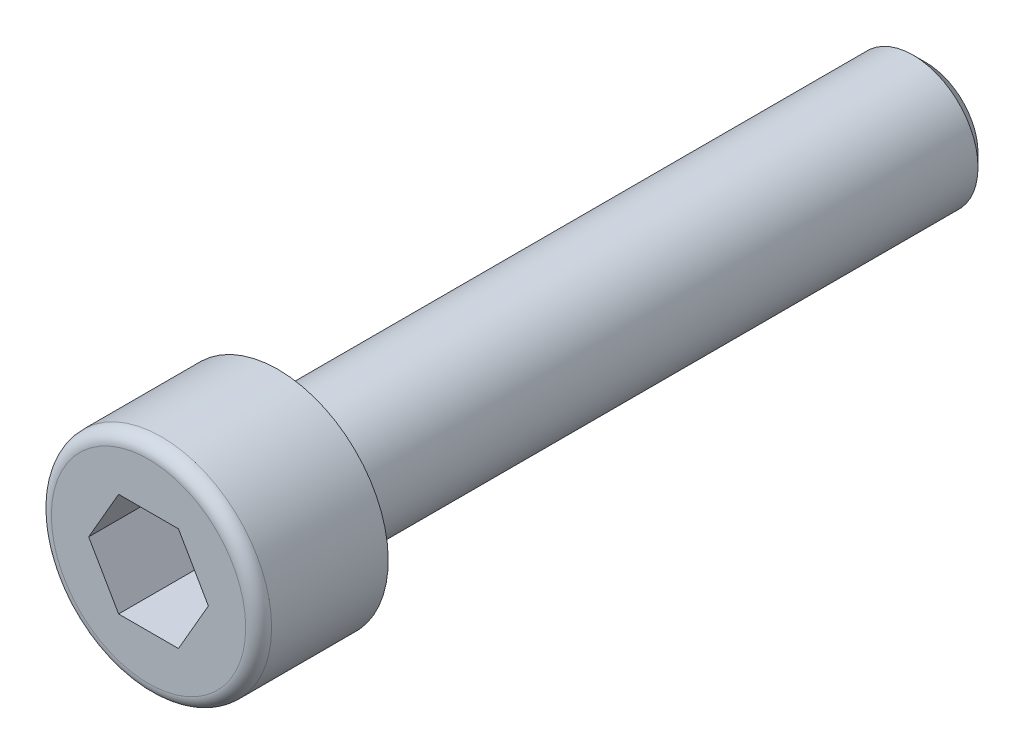
ISO-10303-21;
HEADER;
FILE_DESCRIPTION(('STEP AP214'),'2;1');
FILE_NAME('part.step','',(''),(''),'','','');
FILE_SCHEMA(('AUTOMOTIVE_DESIGN { 1 0 10303 214 1 1 1 1 }'));
ENDSEC;
DATA;
#1=APPLICATION_CONTEXT('core data for automotive mechanical design processes');
#2=APPLICATION_PROTOCOL_DEFINITION('international standard','automotive_design',2000,#1);
#3=PRODUCT_CONTEXT('',#1,'mechanical');
#4=PRODUCT('Part','Part','',(#3));
#5=PRODUCT_RELATED_PRODUCT_CATEGORY('part','',(#4));
#6=PRODUCT_DEFINITION_FORMATION('','',#4);
#7=PRODUCT_DEFINITION_CONTEXT('part definition',#1,'design');
#8=PRODUCT_DEFINITION('design','',#6,#7);
#9=PRODUCT_DEFINITION_SHAPE('','',#8);
#10=(LENGTH_UNIT() NAMED_UNIT(*) SI_UNIT(.MILLI.,.METRE.));
#11=(NAMED_UNIT(*) PLANE_ANGLE_UNIT() SI_UNIT($,.RADIAN.));
#12=(NAMED_UNIT(*) SI_UNIT($,.STERADIAN.) SOLID_ANGLE_UNIT());
#13=UNCERTAINTY_MEASURE_WITH_UNIT(LENGTH_MEASURE(1.E-05),#10,'distance_accuracy_value','');
#14=(GEOMETRIC_REPRESENTATION_CONTEXT(3) GLOBAL_UNCERTAINTY_ASSIGNED_CONTEXT((#13)) GLOBAL_UNIT_ASSIGNED_CONTEXT((#10,
#11,#12)) REPRESENTATION_CONTEXT('',''));
#15=CARTESIAN_POINT('',(0.,0.,0.));
#16=DIRECTION('',(0.,0.,1.));
#17=DIRECTION('',(1.,0.,0.));
#18=AXIS2_PLACEMENT_3D('',#15,#16,#17);
#19=CARTESIAN_POINT('',(0.,0.,1.17786788355576));
#20=DIRECTION('',(0.,0.,-1.));
#21=DIRECTION('',(0.,1.,0.));
#22=AXIS2_PLACEMENT_3D('',#19,#20,#21);
#23=PLANE('',#22);
#24=DIRECTION('',(0.500000000000001,-0.866025403784438,0.));
#25=VECTOR('',#24,1.);
#26=CARTESIAN_POINT('',(1.73205080756888,1.,1.17786788355576));
#27=LINE('',#26,#25);
#28=CARTESIAN_POINT('',(1.15470053837925,2.,1.17786788355576));
#29=VERTEX_POINT('',#28);
#30=CARTESIAN_POINT('',(2.3094010767585,0.,1.17786788355576));
#31=VERTEX_POINT('',#30);
#32=EDGE_CURVE('E72',#29,#31,#27,.T.);
#33=ORIENTED_EDGE('',*,*,#32,.F.);
#34=DIRECTION('',(1.,0.,0.));
#35=VECTOR('',#34,1.);
#36=CARTESIAN_POINT('',(0.,2.,1.17786788355576));
#37=LINE('',#36,#35);
#38=CARTESIAN_POINT('',(-1.15470053837925,2.,1.17786788355576));
#39=VERTEX_POINT('',#38);
#40=EDGE_CURVE('E221',#39,#29,#37,.T.);
#41=ORIENTED_EDGE('',*,*,#40,.F.);
#42=DIRECTION('',(0.5,0.866025403784439,0.));
#43=VECTOR('',#42,1.);
#44=CARTESIAN_POINT('',(-1.73205080756888,0.999999999999999,1.17786788355576));
#45=LINE('',#44,#43);
#46=CARTESIAN_POINT('',(-2.3094010767585,0.,1.17786788355576));
#47=VERTEX_POINT('',#46);
#48=EDGE_CURVE('E224',#47,#39,#45,.T.);
#49=ORIENTED_EDGE('',*,*,#48,.F.);
#50=DIRECTION('',(-0.500000000000001,0.866025403784438,0.));
#51=VECTOR('',#50,1.);
#52=CARTESIAN_POINT('',(-1.73205080756888,-1.,1.17786788355576));
#53=LINE('',#52,#51);
#54=CARTESIAN_POINT('',(-1.15470053837925,-2.,1.17786788355576));
#55=VERTEX_POINT('',#54);
#56=EDGE_CURVE('E229',#55,#47,#53,.T.);
#57=ORIENTED_EDGE('',*,*,#56,.F.);
#58=DIRECTION('',(1.,0.,0.));
#59=VECTOR('',#58,1.);
#60=CARTESIAN_POINT('',(0.,-2.,1.17786788355576));
#61=LINE('',#60,#59);
#62=CARTESIAN_POINT('',(1.15470053837925,-2.,1.17786788355576));
#63=VERTEX_POINT('',#62);
#64=EDGE_CURVE('E83',#63,#55,#61,.F.);
#65=ORIENTED_EDGE('',*,*,#64,.F.);
#66=DIRECTION('',(-0.5,-0.866025403784439,0.));
#67=VECTOR('',#66,1.);
#68=CARTESIAN_POINT('',(1.73205080756888,-0.999999999999999,1.17786788355576));
#69=LINE('',#68,#67);
#70=EDGE_CURVE('E67',#31,#63,#69,.T.);
#71=ORIENTED_EDGE('',*,*,#70,.F.);
#72=EDGE_LOOP('',(#33,#41,#49,#57,#65,#71));
#73=FACE_BOUND('',#72,.T.);
#74=ADVANCED_FACE('F17',(#73),#23,.F.);
#75=CARTESIAN_POINT('',(1.73205080756888,1.,3.08893394177788));
#76=DIRECTION('',(-0.866025403784438,-0.500000000000001,0.));
#77=DIRECTION('',(0.500000000000001,-0.866025403784438,0.));
#78=AXIS2_PLACEMENT_3D('',#75,#76,#77);
#79=PLANE('',#78);
#80=DIRECTION('',(0.,0.,1.));
#81=VECTOR('',#80,1.);
#82=CARTESIAN_POINT('',(2.3094010767585,0.,3.08893394177788));
#83=LINE('',#82,#81);
#84=CARTESIAN_POINT('',(2.3094010767585,0.,5.));
#85=VERTEX_POINT('',#84);
#86=EDGE_CURVE('E74',#85,#31,#83,.F.);
#87=ORIENTED_EDGE('',*,*,#86,.F.);
#88=DIRECTION('',(0.5,-0.866025403784438,0.));
#89=VECTOR('',#88,1.);
#90=CARTESIAN_POINT('',(1.15470053837925,2.,5.));
#91=LINE('',#90,#89);
#92=CARTESIAN_POINT('',(1.15470053837925,2.,5.));
#93=VERTEX_POINT('',#92);
#94=EDGE_CURVE('E210',#93,#85,#91,.T.);
#95=ORIENTED_EDGE('',*,*,#94,.F.);
#96=DIRECTION('',(0.,0.,-1.));
#97=VECTOR('',#96,1.);
#98=CARTESIAN_POINT('',(1.15470053837925,2.,3.08893394177788));
#99=LINE('',#98,#97);
#100=EDGE_CURVE('E77',#29,#93,#99,.F.);
#101=ORIENTED_EDGE('',*,*,#100,.F.);
#102=ORIENTED_EDGE('',*,*,#32,.T.);
#103=EDGE_LOOP('',(#87,#95,#101,#102));
#104=FACE_BOUND('',#103,.T.);
#105=ADVANCED_FACE('F73',(#104),#79,.T.);
#106=CARTESIAN_POINT('',(1.73205080756888,-0.999999999999999,3.08893394177788));
#107=DIRECTION('',(-0.866025403784439,0.5,0.));
#108=DIRECTION('',(-0.5,-0.866025403784439,0.));
#109=AXIS2_PLACEMENT_3D('',#106,#107,#108);
#110=PLANE('',#109);
#111=DIRECTION('',(0.,0.,1.));
#112=VECTOR('',#111,1.);
#113=CARTESIAN_POINT('',(1.15470053837925,-2.,3.08893394177788));
#114=LINE('',#113,#112);
#115=CARTESIAN_POINT('',(1.15470053837925,-2.,5.));
#116=VERTEX_POINT('',#115);
#117=EDGE_CURVE('E85',#116,#63,#114,.F.);
#118=ORIENTED_EDGE('',*,*,#117,.F.);
#119=DIRECTION('',(-0.5,-0.866025403784439,0.));
#120=VECTOR('',#119,1.);
#121=CARTESIAN_POINT('',(2.3094010767585,0.,5.));
#122=LINE('',#121,#120);
#123=EDGE_CURVE('E89',#85,#116,#122,.T.);
#124=ORIENTED_EDGE('',*,*,#123,.F.);
#125=ORIENTED_EDGE('',*,*,#86,.T.);
#126=ORIENTED_EDGE('',*,*,#70,.T.);
#127=EDGE_LOOP('',(#118,#124,#125,#126));
#128=FACE_BOUND('',#127,.T.);
#129=ADVANCED_FACE('F87',(#128),#110,.T.);
#130=CARTESIAN_POINT('',(0.,-2.,3.08893394177788));
#131=DIRECTION('',(0.,1.,0.));
#132=DIRECTION('',(0.,0.,1.));
#133=AXIS2_PLACEMENT_3D('',#130,#131,#132);
#134=PLANE('',#133);
#135=DIRECTION('',(0.,0.,1.));
#136=VECTOR('',#135,1.);
#137=CARTESIAN_POINT('',(-1.15470053837925,-2.,3.08893394177788));
#138=LINE('',#137,#136);
#139=CARTESIAN_POINT('',(-1.15470053837925,-2.,5.));
#140=VERTEX_POINT('',#139);
#141=EDGE_CURVE('E231',#140,#55,#138,.F.);
#142=ORIENTED_EDGE('',*,*,#141,.F.);
#143=DIRECTION('',(1.,0.,0.));
#144=VECTOR('',#143,1.);
#145=CARTESIAN_POINT('',(0.,-2.,5.));
#146=LINE('',#145,#144);
#147=EDGE_CURVE('E236',#116,#140,#146,.F.);
#148=ORIENTED_EDGE('',*,*,#147,.F.);
#149=ORIENTED_EDGE('',*,*,#117,.T.);
#150=ORIENTED_EDGE('',*,*,#64,.T.);
#151=EDGE_LOOP('',(#142,#148,#149,#150));
#152=FACE_BOUND('',#151,.T.);
#153=ADVANCED_FACE('F149',(#152),#134,.T.);
#154=CARTESIAN_POINT('',(-1.73205080756888,-1.,3.08893394177788));
#155=DIRECTION('',(0.866025403784438,0.500000000000001,0.));
#156=DIRECTION('',(-0.500000000000001,0.866025403784438,0.));
#157=AXIS2_PLACEMENT_3D('',#154,#155,#156);
#158=PLANE('',#157);
#159=DIRECTION('',(0.,0.,1.));
#160=VECTOR('',#159,1.);
#161=CARTESIAN_POINT('',(-2.3094010767585,0.,3.08893394177788));
#162=LINE('',#161,#160);
#163=CARTESIAN_POINT('',(-2.3094010767585,0.,5.));
#164=VERTEX_POINT('',#163);
#165=EDGE_CURVE('E226',#164,#47,#162,.F.);
#166=ORIENTED_EDGE('',*,*,#165,.F.);
#167=DIRECTION('',(-0.5,0.866025403784439,0.));
#168=VECTOR('',#167,1.);
#169=CARTESIAN_POINT('',(-1.15470053837925,-2.,5.));
#170=LINE('',#169,#168);
#171=EDGE_CURVE('E240',#140,#164,#170,.T.);
#172=ORIENTED_EDGE('',*,*,#171,.F.);
#173=ORIENTED_EDGE('',*,*,#141,.T.);
#174=ORIENTED_EDGE('',*,*,#56,.T.);
#175=EDGE_LOOP('',(#166,#172,#173,#174));
#176=FACE_BOUND('',#175,.T.);
#177=ADVANCED_FACE('F146',(#176),#158,.T.);
#178=CARTESIAN_POINT('',(-1.73205080756888,0.999999999999999,3.08893394177788));
#179=DIRECTION('',(0.866025403784439,-0.5,0.));
#180=DIRECTION('',(0.5,0.866025403784439,0.));
#181=AXIS2_PLACEMENT_3D('',#178,#179,#180);
#182=PLANE('',#181);
#183=DIRECTION('',(0.,0.,-1.));
#184=VECTOR('',#183,1.);
#185=CARTESIAN_POINT('',(-1.15470053837925,2.,3.08893394177788));
#186=LINE('',#185,#184);
#187=CARTESIAN_POINT('',(-1.15470053837925,2.,5.));
#188=VERTEX_POINT('',#187);
#189=EDGE_CURVE('E35',#188,#39,#186,.T.);
#190=ORIENTED_EDGE('',*,*,#189,.F.);
#191=DIRECTION('',(0.499999999999999,0.866025403784439,0.));
#192=VECTOR('',#191,1.);
#193=CARTESIAN_POINT('',(-2.3094010767585,0.,5.));
#194=LINE('',#193,#192);
#195=EDGE_CURVE('E245',#164,#188,#194,.T.);
#196=ORIENTED_EDGE('',*,*,#195,.F.);
#197=ORIENTED_EDGE('',*,*,#165,.T.);
#198=ORIENTED_EDGE('',*,*,#48,.T.);
#199=EDGE_LOOP('',(#190,#196,#197,#198));
#200=FACE_BOUND('',#199,.T.);
#201=ADVANCED_FACE('F142',(#200),#182,.T.);
#202=CARTESIAN_POINT('',(0.,2.,3.08893394177788));
#203=DIRECTION('',(0.,-1.,0.));
#204=DIRECTION('',(0.,0.,-1.));
#205=AXIS2_PLACEMENT_3D('',#202,#203,#204);
#206=PLANE('',#205);
#207=ORIENTED_EDGE('',*,*,#100,.T.);
#208=DIRECTION('',(1.,0.,0.));
#209=VECTOR('',#208,1.);
#210=CARTESIAN_POINT('',(0.,2.,5.));
#211=LINE('',#210,#209);
#212=EDGE_CURVE('E114',#188,#93,#211,.T.);
#213=ORIENTED_EDGE('',*,*,#212,.F.);
#214=ORIENTED_EDGE('',*,*,#189,.T.);
#215=ORIENTED_EDGE('',*,*,#40,.T.);
#216=EDGE_LOOP('',(#207,#213,#214,#215));
#217=FACE_BOUND('',#216,.T.);
#218=ADVANCED_FACE('F137',(#217),#206,.T.);
#219=CARTESIAN_POINT('',(0.,0.,5.));
#220=DIRECTION('',(0.,0.,1.));
#221=DIRECTION('',(0.,-1.,0.));
#222=AXIS2_PLACEMENT_3D('',#219,#220,#221);
#223=PLANE('',#222);
#224=CARTESIAN_POINT('',(0.,0.,5.));
#225=DIRECTION('',(0.,0.,-1.));
#226=DIRECTION('',(1.,0.,0.));
#227=AXIS2_PLACEMENT_3D('',#224,#225,#226);
#228=CIRCLE('',#227,3.75);
#229=CARTESIAN_POINT('',(3.75,0.,5.));
#230=VERTEX_POINT('',#229);
#231=EDGE_CURVE('E109',#230,#230,#228,.T.);
#232=ORIENTED_EDGE('',*,*,#231,.F.);
#233=EDGE_LOOP('',(#232));
#234=FACE_BOUND('',#233,.T.);
#235=ORIENTED_EDGE('',*,*,#195,.T.);
#236=ORIENTED_EDGE('',*,*,#212,.T.);
#237=ORIENTED_EDGE('',*,*,#94,.T.);
#238=ORIENTED_EDGE('',*,*,#123,.T.);
#239=ORIENTED_EDGE('',*,*,#147,.T.);
#240=ORIENTED_EDGE('',*,*,#171,.T.);
#241=EDGE_LOOP('',(#235,#236,#237,#238,#239,#240));
#242=FACE_BOUND('',#241,.T.);
#243=ADVANCED_FACE('F126',(#234,#242),#223,.T.);
#244=CARTESIAN_POINT('',(0.,0.,4.5));
#245=DIRECTION('',(0.,0.,-1.));
#246=DIRECTION('',(1.,0.,0.));
#247=AXIS2_PLACEMENT_3D('',#244,#245,#246);
#248=TOROIDAL_SURFACE('',#247,3.75,0.5);
#249=CARTESIAN_POINT('',(0.,0.,4.5));
#250=DIRECTION('',(0.,0.,-1.));
#251=DIRECTION('',(0.,1.,0.));
#252=AXIS2_PLACEMENT_3D('',#249,#250,#251);
#253=CIRCLE('',#252,4.25);
#254=CARTESIAN_POINT('',(0.,4.25,4.5));
#255=VERTEX_POINT('',#254);
#256=EDGE_CURVE('E105',#255,#255,#253,.T.);
#257=ORIENTED_EDGE('',*,*,#256,.F.);
#258=EDGE_LOOP('',(#257));
#259=FACE_BOUND('',#258,.T.);
#260=ORIENTED_EDGE('',*,*,#231,.T.);
#261=EDGE_LOOP('',(#260));
#262=FACE_BOUND('',#261,.T.);
#263=ADVANCED_FACE('F136',(#259,#262),#248,.T.);
#264=CARTESIAN_POINT('',(0.,0.,2.25));
#265=DIRECTION('',(0.,0.,-1.));
#266=DIRECTION('',(0.,1.,0.));
#267=AXIS2_PLACEMENT_3D('',#264,#265,#266);
#268=CYLINDRICAL_SURFACE('',#267,4.25);
#269=CARTESIAN_POINT('',(0.,0.,0.));
#270=DIRECTION('',(0.,0.,-1.));
#271=DIRECTION('',(0.,1.,0.));
#272=AXIS2_PLACEMENT_3D('',#269,#270,#271);
#273=CIRCLE('',#272,4.25);
#274=CARTESIAN_POINT('',(0.,4.25,0.));
#275=VERTEX_POINT('',#274);
#276=EDGE_CURVE('E20',#275,#275,#273,.T.);
#277=ORIENTED_EDGE('',*,*,#276,.F.);
#278=EDGE_LOOP('',(#277));
#279=FACE_BOUND('',#278,.T.);
#280=ORIENTED_EDGE('',*,*,#256,.T.);
#281=EDGE_LOOP('',(#280));
#282=FACE_BOUND('',#281,.T.);
#283=ADVANCED_FACE('F197',(#279,#282),#268,.T.);
#284=CARTESIAN_POINT('',(0.,0.,0.));
#285=DIRECTION('',(0.,0.,-1.));
#286=DIRECTION('',(0.,1.,0.));
#287=AXIS2_PLACEMENT_3D('',#284,#285,#286);
#288=PLANE('',#287);
#289=ORIENTED_EDGE('',*,*,#276,.T.);
#290=EDGE_LOOP('',(#289));
#291=FACE_BOUND('',#290,.T.);
#292=CARTESIAN_POINT('',(0.,0.,0.));
#293=DIRECTION('',(0.,0.,-1.));
#294=DIRECTION('',(1.,0.,0.));
#295=AXIS2_PLACEMENT_3D('',#292,#293,#294);
#296=CIRCLE('',#295,2.7);
#297=CARTESIAN_POINT('',(2.7,0.,0.));
#298=VERTEX_POINT('',#297);
#299=EDGE_CURVE('E95',#298,#298,#296,.F.);
#300=ORIENTED_EDGE('',*,*,#299,.T.);
#301=EDGE_LOOP('',(#300));
#302=FACE_BOUND('',#301,.T.);
#303=ADVANCED_FACE('F189',(#291,#302),#288,.T.);
#304=CARTESIAN_POINT('',(0.,0.,-25.));
#305=DIRECTION('',(0.,0.,1.));
#306=DIRECTION('',(0.,-1.,0.));
#307=AXIS2_PLACEMENT_3D('',#304,#305,#306);
#308=PLANE('',#307);
#309=CARTESIAN_POINT('',(0.,0.,-25.0000000000909));
#310=DIRECTION('',(0.,0.,1.));
#311=DIRECTION('',(1.,0.,0.));
#312=AXIS2_PLACEMENT_3D('',#309,#310,#311);
#313=CIRCLE('',#312,2.00924999995777);
#314=CARTESIAN_POINT('',(2.00924999995777,0.,-25.0000000000909));
#315=VERTEX_POINT('',#314);
#316=EDGE_CURVE('E93',#315,#315,#313,.T.);
#317=ORIENTED_EDGE('',*,*,#316,.F.);
#318=EDGE_LOOP('',(#317));
#319=FACE_BOUND('',#318,.T.);
#320=ADVANCED_FACE('F180',(#319),#308,.F.);
#321=CARTESIAN_POINT('',(0.,0.,-0.2));
#322=DIRECTION('',(0.,0.,-1.));
#323=DIRECTION('',(1.,0.,0.));
#324=AXIS2_PLACEMENT_3D('',#321,#322,#323);
#325=TOROIDAL_SURFACE('',#324,2.7,0.2);
#326=ORIENTED_EDGE('',*,*,#299,.F.);
#327=EDGE_LOOP('',(#326));
#328=FACE_BOUND('',#327,.T.);
#329=CARTESIAN_POINT('',(0.,0.,-0.200000000000001));
#330=DIRECTION('',(0.,0.,-1.));
#331=DIRECTION('',(0.,1.,0.));
#332=AXIS2_PLACEMENT_3D('',#329,#330,#331);
#333=CIRCLE('',#332,2.5);
#334=CARTESIAN_POINT('',(0.,2.5,-0.200000000000001));
#335=VERTEX_POINT('',#334);
#336=EDGE_CURVE('E26',#335,#335,#333,.T.);
#337=ORIENTED_EDGE('',*,*,#336,.F.);
#338=EDGE_LOOP('',(#337));
#339=FACE_BOUND('',#338,.T.);
#340=ADVANCED_FACE('F169',(#328,#339),#325,.F.);
#341=CARTESIAN_POINT('',(0.,0.,-24.509250000051));
#342=DIRECTION('',(0.,0.,1.));
#343=DIRECTION('',(1.,0.,0.));
#344=AXIS2_PLACEMENT_3D('',#341,#342,#343);
#345=CONICAL_SURFACE('',#344,2.49999999999773,0.785398163397448);
#346=ORIENTED_EDGE('',*,*,#316,.T.);
#347=EDGE_LOOP('',(#346));
#348=FACE_BOUND('',#347,.T.);
#349=CARTESIAN_POINT('',(0.,0.,-24.50925));
#350=DIRECTION('',(0.,0.,-1.));
#351=DIRECTION('',(0.,1.,0.));
#352=AXIS2_PLACEMENT_3D('',#349,#350,#351);
#353=CIRCLE('',#352,2.5);
#354=CARTESIAN_POINT('',(0.,2.5,-24.50925));
#355=VERTEX_POINT('',#354);
#356=EDGE_CURVE('E11',#355,#355,#353,.F.);
#357=ORIENTED_EDGE('',*,*,#356,.F.);
#358=EDGE_LOOP('',(#357));
#359=FACE_BOUND('',#358,.T.);
#360=ADVANCED_FACE('F162',(#348,#359),#345,.T.);
#361=CARTESIAN_POINT('',(0.,0.,-12.254625));
#362=DIRECTION('',(0.,0.,-1.));
#363=DIRECTION('',(0.,1.,0.));
#364=AXIS2_PLACEMENT_3D('',#361,#362,#363);
#365=CYLINDRICAL_SURFACE('',#364,2.5);
#366=ORIENTED_EDGE('',*,*,#336,.T.);
#367=EDGE_LOOP('',(#366));
#368=FACE_BOUND('',#367,.T.);
#369=ORIENTED_EDGE('',*,*,#356,.T.);
#370=EDGE_LOOP('',(#369));
#371=FACE_BOUND('',#370,.T.);
#372=ADVANCED_FACE('F160',(#368,#371),#365,.T.);
#373=CLOSED_SHELL('',(#74,#105,#129,#153,#177,#201,#218,#243,#263,#283,#303,#320,#340,#360,#372));
#374=CARTESIAN_POINT('',(0.,0.,0.));
#375=DIRECTION('',(0.,0.,-1.));
#376=DIRECTION('',(1.,0.,0.));
#377=AXIS2_PLACEMENT_3D('',#374,#375,#376);
#378=TOROIDAL_SURFACE('',#377,2.5,0.05);
#379=ADVANCED_FACE('F173',(),#378,.F.);
#380=CLOSED_SHELL('',(#379));
#381=ORIENTED_CLOSED_SHELL('',*,#380,.T.);
#382=BREP_WITH_VOIDS('B1',#373,(#381));
#383=ADVANCED_BREP_SHAPE_REPRESENTATION('',(#18,#382),#14);
#384=SHAPE_DEFINITION_REPRESENTATION(#9,#383);
ENDSEC;
END-ISO-10303-21;
